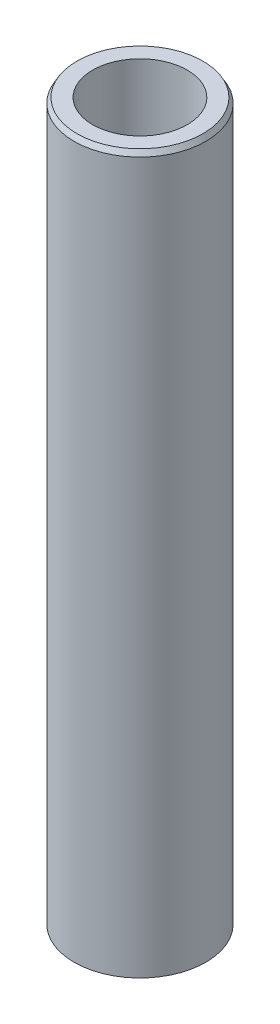
ISO-10303-21;
HEADER;
FILE_DESCRIPTION(('STEP AP214'),'2;1');
FILE_NAME('part.step','',(''),(''),'','','');
FILE_SCHEMA(('AUTOMOTIVE_DESIGN { 1 0 10303 214 1 1 1 1 }'));
ENDSEC;
DATA;
#1=APPLICATION_CONTEXT('core data for automotive mechanical design processes');
#2=APPLICATION_PROTOCOL_DEFINITION('international standard','automotive_design',2000,#1);
#3=PRODUCT_CONTEXT('',#1,'mechanical');
#4=PRODUCT('Part','Part','',(#3));
#5=PRODUCT_RELATED_PRODUCT_CATEGORY('part','',(#4));
#6=PRODUCT_DEFINITION_FORMATION('','',#4);
#7=PRODUCT_DEFINITION_CONTEXT('part definition',#1,'design');
#8=PRODUCT_DEFINITION('design','',#6,#7);
#9=PRODUCT_DEFINITION_SHAPE('','',#8);
#10=(LENGTH_UNIT() NAMED_UNIT(*) SI_UNIT(.MILLI.,.METRE.));
#11=(NAMED_UNIT(*) PLANE_ANGLE_UNIT() SI_UNIT($,.RADIAN.));
#12=(NAMED_UNIT(*) SI_UNIT($,.STERADIAN.) SOLID_ANGLE_UNIT());
#13=UNCERTAINTY_MEASURE_WITH_UNIT(LENGTH_MEASURE(1.E-05),#10,'distance_accuracy_value','');
#14=(GEOMETRIC_REPRESENTATION_CONTEXT(3) GLOBAL_UNCERTAINTY_ASSIGNED_CONTEXT((#13)) GLOBAL_UNIT_ASSIGNED_CONTEXT((#10,
#11,#12)) REPRESENTATION_CONTEXT('',''));
#15=CARTESIAN_POINT('',(0.,0.,0.));
#16=DIRECTION('',(0.,0.,1.));
#17=DIRECTION('',(1.,0.,0.));
#18=AXIS2_PLACEMENT_3D('',#15,#16,#17);
#19=CARTESIAN_POINT('',(0.,600.,0.));
#20=DIRECTION('',(0.,-1.,0.));
#21=DIRECTION('',(0.,0.,-1.));
#22=AXIS2_PLACEMENT_3D('',#19,#20,#21);
#23=CYLINDRICAL_SURFACE('',#22,55.);
#24=CARTESIAN_POINT('',(0.,595.713151042666,0.));
#25=DIRECTION('',(0.,1.,0.));
#26=DIRECTION('',(0.,0.,1.));
#27=AXIS2_PLACEMENT_3D('',#24,#25,#26);
#28=CIRCLE('',#27,55.);
#29=CARTESIAN_POINT('',(0.,595.713151042666,55.));
#30=VERTEX_POINT('',#29);
#31=EDGE_CURVE('E50',#30,#30,#28,.F.);
#32=ORIENTED_EDGE('',*,*,#31,.T.);
#33=EDGE_LOOP('',(#32));
#34=FACE_BOUND('',#33,.T.);
#35=CARTESIAN_POINT('',(0.,2.4750133994923,0.));
#36=DIRECTION('',(0.,1.,0.));
#37=DIRECTION('',(0.,0.,1.));
#38=AXIS2_PLACEMENT_3D('',#35,#36,#37);
#39=CIRCLE('',#38,55.);
#40=CARTESIAN_POINT('',(0.,2.4750133994923,55.));
#41=VERTEX_POINT('',#40);
#42=EDGE_CURVE('E51',#41,#41,#39,.T.);
#43=ORIENTED_EDGE('',*,*,#42,.T.);
#44=EDGE_LOOP('',(#43));
#45=FACE_BOUND('',#44,.T.);
#46=ADVANCED_FACE('F39',(#34,#45),#23,.T.);
#47=CARTESIAN_POINT('',(0.,600.,0.));
#48=DIRECTION('',(0.,1.,0.));
#49=DIRECTION('',(0.,0.,1.));
#50=AXIS2_PLACEMENT_3D('',#47,#48,#49);
#51=PLANE('',#50);
#52=CARTESIAN_POINT('',(0.,600.,0.));
#53=DIRECTION('',(0.,1.,0.));
#54=DIRECTION('',(0.,0.,1.));
#55=AXIS2_PLACEMENT_3D('',#52,#53,#54);
#56=CIRCLE('',#55,52.5249866005077);
#57=CARTESIAN_POINT('',(0.,600.,52.5249866005077));
#58=VERTEX_POINT('',#57);
#59=EDGE_CURVE('E54',#58,#58,#56,.T.);
#60=ORIENTED_EDGE('',*,*,#59,.T.);
#61=EDGE_LOOP('',(#60));
#62=FACE_BOUND('',#61,.T.);
#63=CARTESIAN_POINT('',(0.,600.,0.));
#64=DIRECTION('',(0.,1.,0.));
#65=DIRECTION('',(0.,0.,1.));
#66=AXIS2_PLACEMENT_3D('',#63,#64,#65);
#67=CIRCLE('',#66,39.4896827250058);
#68=CARTESIAN_POINT('',(0.,600.,39.4896827250058));
#69=VERTEX_POINT('',#68);
#70=EDGE_CURVE('E58',#69,#69,#67,.T.);
#71=ORIENTED_EDGE('',*,*,#70,.F.);
#72=EDGE_LOOP('',(#71));
#73=FACE_BOUND('',#72,.T.);
#74=ADVANCED_FACE('F69',(#62,#73),#51,.T.);
#75=CARTESIAN_POINT('',(0.,0.,0.));
#76=DIRECTION('',(0.,1.,0.));
#77=DIRECTION('',(0.,0.,1.));
#78=AXIS2_PLACEMENT_3D('',#75,#76,#77);
#79=PLANE('',#78);
#80=CARTESIAN_POINT('',(0.,0.,0.));
#81=DIRECTION('',(0.,1.,0.));
#82=DIRECTION('',(0.,0.,1.));
#83=AXIS2_PLACEMENT_3D('',#80,#81,#82);
#84=CIRCLE('',#83,50.7131510426655);
#85=CARTESIAN_POINT('',(0.,0.,50.7131510426655));
#86=VERTEX_POINT('',#85);
#87=EDGE_CURVE('E10',#86,#86,#84,.F.);
#88=ORIENTED_EDGE('',*,*,#87,.T.);
#89=EDGE_LOOP('',(#88));
#90=FACE_BOUND('',#89,.T.);
#91=CARTESIAN_POINT('',(0.,0.,0.));
#92=DIRECTION('',(0.,1.,0.));
#93=DIRECTION('',(0.,0.,1.));
#94=AXIS2_PLACEMENT_3D('',#91,#92,#93);
#95=CIRCLE('',#94,39.4896827250058);
#96=CARTESIAN_POINT('',(0.,0.,39.4896827250058));
#97=VERTEX_POINT('',#96);
#98=EDGE_CURVE('E63',#97,#97,#95,.T.);
#99=ORIENTED_EDGE('',*,*,#98,.T.);
#100=EDGE_LOOP('',(#99));
#101=FACE_BOUND('',#100,.T.);
#102=ADVANCED_FACE('F75',(#90,#101),#79,.F.);
#103=CARTESIAN_POINT('',(0.,600.,0.));
#104=DIRECTION('',(0.,-1.,0.));
#105=DIRECTION('',(0.,0.,-1.));
#106=AXIS2_PLACEMENT_3D('',#103,#104,#105);
#107=CYLINDRICAL_SURFACE('',#106,39.4896827250058);
#108=ORIENTED_EDGE('',*,*,#70,.T.);
#109=EDGE_LOOP('',(#108));
#110=FACE_BOUND('',#109,.T.);
#111=ORIENTED_EDGE('',*,*,#98,.F.);
#112=EDGE_LOOP('',(#111));
#113=FACE_BOUND('',#112,.T.);
#114=ADVANCED_FACE('F70',(#110,#113),#107,.F.);
#115=CARTESIAN_POINT('',(0.,600.,0.));
#116=DIRECTION('',(0.,-1.,0.));
#117=DIRECTION('',(0.,0.,-1.));
#118=AXIS2_PLACEMENT_3D('',#115,#116,#117);
#119=CONICAL_SURFACE('',#118,52.5249866005077,0.523598775598298);
#120=ORIENTED_EDGE('',*,*,#31,.F.);
#121=EDGE_LOOP('',(#120));
#122=FACE_BOUND('',#121,.T.);
#123=ORIENTED_EDGE('',*,*,#59,.F.);
#124=EDGE_LOOP('',(#123));
#125=FACE_BOUND('',#124,.T.);
#126=ADVANCED_FACE('F81',(#122,#125),#119,.T.);
#127=CARTESIAN_POINT('',(0.,2.4750133994923,0.));
#128=DIRECTION('',(0.,1.,0.));
#129=DIRECTION('',(0.,0.,1.));
#130=AXIS2_PLACEMENT_3D('',#127,#128,#129);
#131=CONICAL_SURFACE('',#130,55.,1.04719755119661);
#132=ORIENTED_EDGE('',*,*,#87,.F.);
#133=EDGE_LOOP('',(#132));
#134=FACE_BOUND('',#133,.T.);
#135=ORIENTED_EDGE('',*,*,#42,.F.);
#136=EDGE_LOOP('',(#135));
#137=FACE_BOUND('',#136,.T.);
#138=ADVANCED_FACE('F45',(#134,#137),#131,.T.);
#139=CLOSED_SHELL('',(#46,#74,#102,#114,#126,#138));
#140=MANIFOLD_SOLID_BREP('B2',#139);
#141=ADVANCED_BREP_SHAPE_REPRESENTATION('',(#18,#140),#14);
#142=SHAPE_DEFINITION_REPRESENTATION(#9,#141);
ENDSEC;
END-ISO-10303-21;
